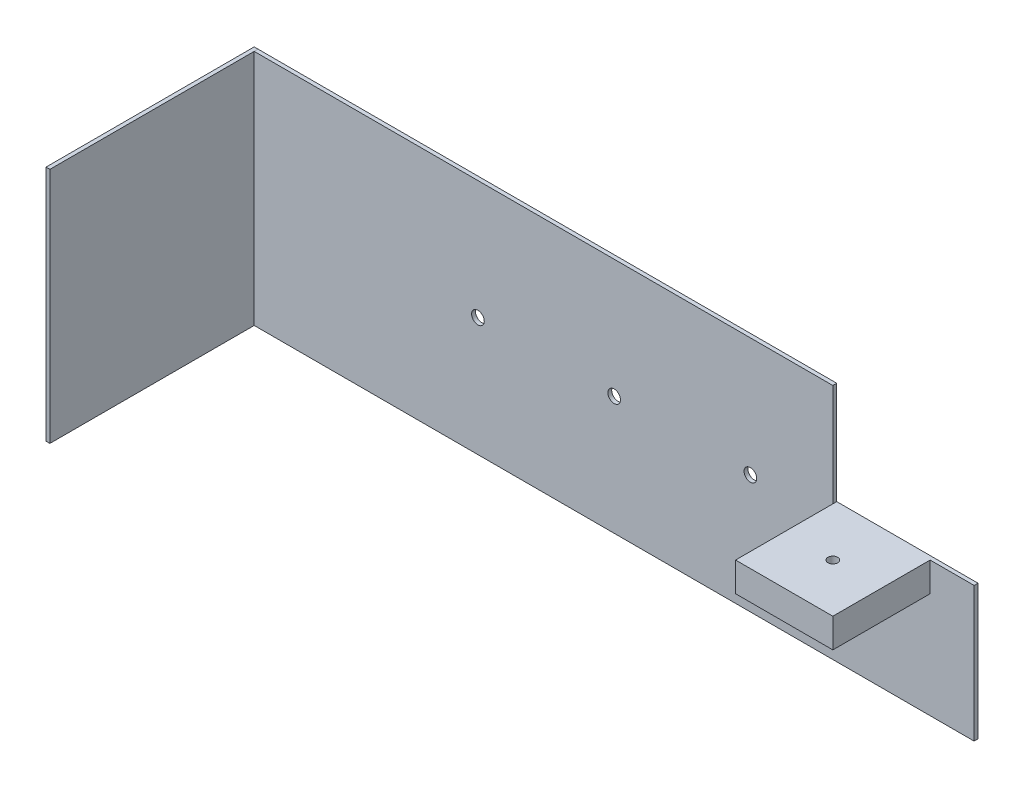
ISO-10303-21;
HEADER;
FILE_DESCRIPTION(('STEP AP214'),'2;1');
FILE_NAME('part.step','',(''),(''),'','','');
FILE_SCHEMA(('AUTOMOTIVE_DESIGN { 1 0 10303 214 1 1 1 1 }'));
ENDSEC;
DATA;
#1=APPLICATION_CONTEXT('core data for automotive mechanical design processes');
#2=APPLICATION_PROTOCOL_DEFINITION('international standard','automotive_design',2000,#1);
#3=PRODUCT_CONTEXT('',#1,'mechanical');
#4=PRODUCT('Part','Part','',(#3));
#5=PRODUCT_RELATED_PRODUCT_CATEGORY('part','',(#4));
#6=PRODUCT_DEFINITION_FORMATION('','',#4);
#7=PRODUCT_DEFINITION_CONTEXT('part definition',#1,'design');
#8=PRODUCT_DEFINITION('design','',#6,#7);
#9=PRODUCT_DEFINITION_SHAPE('','',#8);
#10=(LENGTH_UNIT() NAMED_UNIT(*) SI_UNIT(.MILLI.,.METRE.));
#11=(NAMED_UNIT(*) PLANE_ANGLE_UNIT() SI_UNIT($,.RADIAN.));
#12=(NAMED_UNIT(*) SI_UNIT($,.STERADIAN.) SOLID_ANGLE_UNIT());
#13=UNCERTAINTY_MEASURE_WITH_UNIT(LENGTH_MEASURE(1.E-05),#10,'distance_accuracy_value','');
#14=(GEOMETRIC_REPRESENTATION_CONTEXT(3) GLOBAL_UNCERTAINTY_ASSIGNED_CONTEXT((#13)) GLOBAL_UNIT_ASSIGNED_CONTEXT((#10,
#11,#12)) REPRESENTATION_CONTEXT('',''));
#15=CARTESIAN_POINT('',(0.,0.,0.));
#16=DIRECTION('',(0.,0.,1.));
#17=DIRECTION('',(1.,0.,0.));
#18=AXIS2_PLACEMENT_3D('',#15,#16,#17);
#19=CARTESIAN_POINT('',(-185.,61.,0.));
#20=DIRECTION('',(1.,0.,0.));
#21=DIRECTION('',(0.,1.,0.));
#22=AXIS2_PLACEMENT_3D('',#19,#20,#21);
#23=PLANE('',#22);
#24=DIRECTION('',(0.,0.,1.));
#25=VECTOR('',#24,1.);
#26=CARTESIAN_POINT('',(-185.,61.,0.));
#27=LINE('',#26,#25);
#28=CARTESIAN_POINT('',(-185.,61.,0.));
#29=VERTEX_POINT('',#28);
#30=CARTESIAN_POINT('',(-185.,61.,107.));
#31=VERTEX_POINT('',#30);
#32=EDGE_CURVE('E49',#29,#31,#27,.T.);
#33=ORIENTED_EDGE('',*,*,#32,.T.);
#34=DIRECTION('',(0.,1.,0.));
#35=VECTOR('',#34,1.);
#36=CARTESIAN_POINT('',(-185.,61.,107.));
#37=LINE('',#36,#35);
#38=CARTESIAN_POINT('',(-185.,-61.,107.));
#39=VERTEX_POINT('',#38);
#40=EDGE_CURVE('E86',#39,#31,#37,.T.);
#41=ORIENTED_EDGE('',*,*,#40,.F.);
#42=DIRECTION('',(0.,0.,1.));
#43=VECTOR('',#42,1.);
#44=CARTESIAN_POINT('',(-185.,-61.,0.));
#45=LINE('',#44,#43);
#46=CARTESIAN_POINT('',(-185.,-61.,0.));
#47=VERTEX_POINT('',#46);
#48=EDGE_CURVE('E12',#47,#39,#45,.T.);
#49=ORIENTED_EDGE('',*,*,#48,.F.);
#50=DIRECTION('',(0.,1.,0.));
#51=VECTOR('',#50,1.);
#52=CARTESIAN_POINT('',(-185.,61.,0.));
#53=LINE('',#52,#51);
#54=EDGE_CURVE('E87',#47,#29,#53,.T.);
#55=ORIENTED_EDGE('',*,*,#54,.T.);
#56=EDGE_LOOP('',(#33,#41,#49,#55));
#57=FACE_BOUND('',#56,.T.);
#58=ADVANCED_FACE('F46',(#57),#23,.T.);
#59=CARTESIAN_POINT('',(-185.,-61.,0.));
#60=DIRECTION('',(0.,-1.,0.));
#61=DIRECTION('',(0.,0.,-1.));
#62=AXIS2_PLACEMENT_3D('',#59,#60,#61);
#63=PLANE('',#62);
#64=ORIENTED_EDGE('',*,*,#48,.T.);
#65=DIRECTION('',(1.,0.,0.));
#66=VECTOR('',#65,1.);
#67=CARTESIAN_POINT('',(-185.,-61.,107.));
#68=LINE('',#67,#66);
#69=CARTESIAN_POINT('',(-187.,-61.,107.));
#70=VERTEX_POINT('',#69);
#71=EDGE_CURVE('E103',#70,#39,#68,.T.);
#72=ORIENTED_EDGE('',*,*,#71,.F.);
#73=DIRECTION('',(0.,0.,1.));
#74=VECTOR('',#73,1.);
#75=CARTESIAN_POINT('',(-187.,-61.,0.));
#76=LINE('',#75,#74);
#77=CARTESIAN_POINT('',(-187.,-61.,0.));
#78=VERTEX_POINT('',#77);
#79=EDGE_CURVE('E54',#78,#70,#76,.T.);
#80=ORIENTED_EDGE('',*,*,#79,.F.);
#81=DIRECTION('',(1.,0.,0.));
#82=VECTOR('',#81,1.);
#83=CARTESIAN_POINT('',(-185.,-61.,0.));
#84=LINE('',#83,#82);
#85=EDGE_CURVE('E92',#78,#47,#84,.T.);
#86=ORIENTED_EDGE('',*,*,#85,.T.);
#87=EDGE_LOOP('',(#64,#72,#80,#86));
#88=FACE_BOUND('',#87,.T.);
#89=ADVANCED_FACE('F118',(#88),#63,.T.);
#90=CARTESIAN_POINT('',(-187.,61.,0.));
#91=DIRECTION('',(-1.,0.,0.));
#92=DIRECTION('',(0.,-1.,0.));
#93=AXIS2_PLACEMENT_3D('',#90,#91,#92);
#94=PLANE('',#93);
#95=ORIENTED_EDGE('',*,*,#79,.T.);
#96=DIRECTION('',(0.,-1.,0.));
#97=VECTOR('',#96,1.);
#98=CARTESIAN_POINT('',(-187.,61.,107.));
#99=LINE('',#98,#97);
#100=CARTESIAN_POINT('',(-187.,61.,107.));
#101=VERTEX_POINT('',#100);
#102=EDGE_CURVE('E99',#101,#70,#99,.T.);
#103=ORIENTED_EDGE('',*,*,#102,.F.);
#104=DIRECTION('',(0.,0.,1.));
#105=VECTOR('',#104,1.);
#106=CARTESIAN_POINT('',(-187.,61.,0.));
#107=LINE('',#106,#105);
#108=CARTESIAN_POINT('',(-187.,61.,0.));
#109=VERTEX_POINT('',#108);
#110=EDGE_CURVE('E91',#109,#101,#107,.T.);
#111=ORIENTED_EDGE('',*,*,#110,.F.);
#112=DIRECTION('',(0.,-1.,0.));
#113=VECTOR('',#112,1.);
#114=CARTESIAN_POINT('',(-187.,61.,0.));
#115=LINE('',#114,#113);
#116=EDGE_CURVE('E111',#109,#78,#115,.T.);
#117=ORIENTED_EDGE('',*,*,#116,.T.);
#118=EDGE_LOOP('',(#95,#103,#111,#117));
#119=FACE_BOUND('',#118,.T.);
#120=ADVANCED_FACE('F115',(#119),#94,.T.);
#121=CARTESIAN_POINT('',(-185.,61.,0.));
#122=DIRECTION('',(0.,1.,0.));
#123=DIRECTION('',(0.,0.,1.));
#124=AXIS2_PLACEMENT_3D('',#121,#122,#123);
#125=PLANE('',#124);
#126=ORIENTED_EDGE('',*,*,#110,.T.);
#127=DIRECTION('',(-1.,0.,0.));
#128=VECTOR('',#127,1.);
#129=CARTESIAN_POINT('',(-185.,61.,107.));
#130=LINE('',#129,#128);
#131=EDGE_CURVE('E94',#31,#101,#130,.T.);
#132=ORIENTED_EDGE('',*,*,#131,.F.);
#133=ORIENTED_EDGE('',*,*,#32,.F.);
#134=DIRECTION('',(-1.,0.,0.));
#135=VECTOR('',#134,1.);
#136=CARTESIAN_POINT('',(-185.,61.,0.));
#137=LINE('',#136,#135);
#138=EDGE_CURVE('E109',#29,#109,#137,.T.);
#139=ORIENTED_EDGE('',*,*,#138,.T.);
#140=EDGE_LOOP('',(#126,#132,#133,#139));
#141=FACE_BOUND('',#140,.T.);
#142=ADVANCED_FACE('F95',(#141),#125,.T.);
#143=CARTESIAN_POINT('',(0.,0.,0.));
#144=DIRECTION('',(0.,0.,-1.));
#145=DIRECTION('',(-1.,0.,0.));
#146=AXIS2_PLACEMENT_3D('',#143,#144,#145);
#147=PLANE('',#146);
#148=ORIENTED_EDGE('',*,*,#54,.F.);
#149=ORIENTED_EDGE('',*,*,#85,.F.);
#150=ORIENTED_EDGE('',*,*,#116,.F.);
#151=ORIENTED_EDGE('',*,*,#138,.F.);
#152=EDGE_LOOP('',(#148,#149,#150,#151));
#153=FACE_BOUND('',#152,.T.);
#154=ADVANCED_FACE('F120',(#153),#147,.T.);
#155=CARTESIAN_POINT('',(0.,0.,107.));
#156=DIRECTION('',(0.,0.,-1.));
#157=DIRECTION('',(-1.,0.,0.));
#158=AXIS2_PLACEMENT_3D('',#155,#156,#157);
#159=PLANE('',#158);
#160=ORIENTED_EDGE('',*,*,#40,.T.);
#161=ORIENTED_EDGE('',*,*,#131,.T.);
#162=ORIENTED_EDGE('',*,*,#102,.T.);
#163=ORIENTED_EDGE('',*,*,#71,.T.);
#164=EDGE_LOOP('',(#160,#161,#162,#163));
#165=FACE_BOUND('',#164,.T.);
#166=ADVANCED_FACE('F102',(#165),#159,.F.);
#167=CLOSED_SHELL('',(#58,#89,#120,#142,#154,#166));
#168=MANIFOLD_SOLID_BREP('B2',#167);
#169=CARTESIAN_POINT('',(0.,0.,2.));
#170=DIRECTION('',(0.,0.,1.));
#171=DIRECTION('',(1.,0.,0.));
#172=AXIS2_PLACEMENT_3D('',#169,#170,#171);
#173=PLANE('',#172);
#174=CARTESIAN_POINT('',(0.,0.,2.));
#175=DIRECTION('',(0.,0.,1.));
#176=DIRECTION('',(1.,0.,0.));
#177=AXIS2_PLACEMENT_3D('',#174,#175,#176);
#178=CIRCLE('',#177,3.25);
#179=CARTESIAN_POINT('',(3.25,0.,2.));
#180=VERTEX_POINT('',#179);
#181=EDGE_CURVE('E431',#180,#180,#178,.T.);
#182=ORIENTED_EDGE('',*,*,#181,.F.);
#183=EDGE_LOOP('',(#182));
#184=FACE_BOUND('',#183,.T.);
#185=CARTESIAN_POINT('',(70.,0.,2.));
#186=DIRECTION('',(0.,0.,1.));
#187=DIRECTION('',(1.,0.,0.));
#188=AXIS2_PLACEMENT_3D('',#185,#186,#187);
#189=CIRCLE('',#188,3.25000000000001);
#190=CARTESIAN_POINT('',(73.25,0.,2.));
#191=VERTEX_POINT('',#190);
#192=EDGE_CURVE('E349',#191,#191,#189,.T.);
#193=ORIENTED_EDGE('',*,*,#192,.F.);
#194=EDGE_LOOP('',(#193));
#195=FACE_BOUND('',#194,.T.);
#196=CARTESIAN_POINT('',(-70.,0.,2.));
#197=DIRECTION('',(0.,0.,1.));
#198=DIRECTION('',(1.,0.,0.));
#199=AXIS2_PLACEMENT_3D('',#196,#197,#198);
#200=CIRCLE('',#199,3.25000000000001);
#201=CARTESIAN_POINT('',(-66.75,0.,2.));
#202=VERTEX_POINT('',#201);
#203=EDGE_CURVE('E343',#202,#202,#200,.T.);
#204=ORIENTED_EDGE('',*,*,#203,.F.);
#205=EDGE_LOOP('',(#204));
#206=FACE_BOUND('',#205,.T.);
#207=DIRECTION('',(1.,0.,0.));
#208=VECTOR('',#207,1.);
#209=CARTESIAN_POINT('',(185.,8.3,2.));
#210=LINE('',#209,#208);
#211=CARTESIAN_POINT('',(162.4,8.3,2.));
#212=VERTEX_POINT('',#211);
#213=CARTESIAN_POINT('',(185.,8.3,2.));
#214=VERTEX_POINT('',#213);
#215=EDGE_CURVE('E265',#212,#214,#210,.T.);
#216=ORIENTED_EDGE('',*,*,#215,.F.);
#217=DIRECTION('',(0.,1.,0.));
#218=VECTOR('',#217,1.);
#219=CARTESIAN_POINT('',(162.4,8.3,2.));
#220=LINE('',#219,#218);
#221=CARTESIAN_POINT('',(162.4,-6.7,2.));
#222=VERTEX_POINT('',#221);
#223=EDGE_CURVE('E362',#222,#212,#220,.T.);
#224=ORIENTED_EDGE('',*,*,#223,.F.);
#225=DIRECTION('',(1.,0.,0.));
#226=VECTOR('',#225,1.);
#227=CARTESIAN_POINT('',(112.4,-6.7,2.));
#228=LINE('',#227,#226);
#229=CARTESIAN_POINT('',(112.4,-6.7,2.));
#230=VERTEX_POINT('',#229);
#231=EDGE_CURVE('E367',#230,#222,#228,.T.);
#232=ORIENTED_EDGE('',*,*,#231,.F.);
#233=DIRECTION('',(0.,-1.,0.));
#234=VECTOR('',#233,1.);
#235=CARTESIAN_POINT('',(112.4,8.3,2.));
#236=LINE('',#235,#234);
#237=CARTESIAN_POINT('',(112.4,8.3,2.));
#238=VERTEX_POINT('',#237);
#239=EDGE_CURVE('E376',#238,#230,#236,.T.);
#240=ORIENTED_EDGE('',*,*,#239,.F.);
#241=DIRECTION('',(0.,-1.,0.));
#242=VECTOR('',#241,1.);
#243=CARTESIAN_POINT('',(112.4,61.,2.));
#244=LINE('',#243,#242);
#245=CARTESIAN_POINT('',(112.4,61.,2.));
#246=VERTEX_POINT('',#245);
#247=EDGE_CURVE('E342',#246,#238,#244,.T.);
#248=ORIENTED_EDGE('',*,*,#247,.F.);
#249=DIRECTION('',(-1.,0.,0.));
#250=VECTOR('',#249,1.);
#251=CARTESIAN_POINT('',(-185.,61.,2.));
#252=LINE('',#251,#250);
#253=CARTESIAN_POINT('',(-185.,61.,2.));
#254=VERTEX_POINT('',#253);
#255=EDGE_CURVE('E216',#246,#254,#252,.T.);
#256=ORIENTED_EDGE('',*,*,#255,.T.);
#257=DIRECTION('',(0.,-1.,0.));
#258=VECTOR('',#257,1.);
#259=CARTESIAN_POINT('',(-185.,61.,2.));
#260=LINE('',#259,#258);
#261=CARTESIAN_POINT('',(-185.,-61.,2.));
#262=VERTEX_POINT('',#261);
#263=EDGE_CURVE('E295',#254,#262,#260,.T.);
#264=ORIENTED_EDGE('',*,*,#263,.T.);
#265=DIRECTION('',(1.,0.,0.));
#266=VECTOR('',#265,1.);
#267=CARTESIAN_POINT('',(-185.,-61.,2.));
#268=LINE('',#267,#266);
#269=CARTESIAN_POINT('',(185.,-61.,2.));
#270=VERTEX_POINT('',#269);
#271=EDGE_CURVE('E194',#262,#270,#268,.T.);
#272=ORIENTED_EDGE('',*,*,#271,.T.);
#273=DIRECTION('',(0.,1.,0.));
#274=VECTOR('',#273,1.);
#275=CARTESIAN_POINT('',(185.,61.,2.));
#276=LINE('',#275,#274);
#277=EDGE_CURVE('E283',#270,#214,#276,.T.);
#278=ORIENTED_EDGE('',*,*,#277,.T.);
#279=EDGE_LOOP('',(#216,#224,#232,#240,#248,#256,#264,#272,#278));
#280=FACE_BOUND('',#279,.T.);
#281=ADVANCED_FACE('F170',(#184,#195,#206,#280),#173,.T.);
#282=CARTESIAN_POINT('',(185.,61.,2.));
#283=DIRECTION('',(-1.,0.,0.));
#284=DIRECTION('',(0.,-1.,0.));
#285=AXIS2_PLACEMENT_3D('',#282,#283,#284);
#286=PLANE('',#285);
#287=DIRECTION('',(0.,1.,0.));
#288=VECTOR('',#287,1.);
#289=CARTESIAN_POINT('',(185.,61.,0.));
#290=LINE('',#289,#288);
#291=CARTESIAN_POINT('',(185.,-61.,0.));
#292=VERTEX_POINT('',#291);
#293=CARTESIAN_POINT('',(185.,8.3,0.));
#294=VERTEX_POINT('',#293);
#295=EDGE_CURVE('E274',#292,#294,#290,.T.);
#296=ORIENTED_EDGE('',*,*,#295,.T.);
#297=DIRECTION('',(0.,0.,1.));
#298=VECTOR('',#297,1.);
#299=CARTESIAN_POINT('',(185.,8.3,0.));
#300=LINE('',#299,#298);
#301=EDGE_CURVE('E293',#294,#214,#300,.T.);
#302=ORIENTED_EDGE('',*,*,#301,.T.);
#303=ORIENTED_EDGE('',*,*,#277,.F.);
#304=DIRECTION('',(0.,0.,-1.));
#305=VECTOR('',#304,1.);
#306=CARTESIAN_POINT('',(185.,-61.,2.));
#307=LINE('',#306,#305);
#308=EDGE_CURVE('E284',#270,#292,#307,.T.);
#309=ORIENTED_EDGE('',*,*,#308,.T.);
#310=EDGE_LOOP('',(#296,#302,#303,#309));
#311=FACE_BOUND('',#310,.T.);
#312=ADVANCED_FACE('F172',(#311),#286,.F.);
#313=CARTESIAN_POINT('',(-185.,61.,2.));
#314=DIRECTION('',(0.,-1.,0.));
#315=DIRECTION('',(0.,0.,-1.));
#316=AXIS2_PLACEMENT_3D('',#313,#314,#315);
#317=PLANE('',#316);
#318=ORIENTED_EDGE('',*,*,#255,.F.);
#319=DIRECTION('',(0.,0.,1.));
#320=VECTOR('',#319,1.);
#321=CARTESIAN_POINT('',(112.4,61.,0.));
#322=LINE('',#321,#320);
#323=CARTESIAN_POINT('',(112.4,61.,0.));
#324=VERTEX_POINT('',#323);
#325=EDGE_CURVE('E257',#324,#246,#322,.T.);
#326=ORIENTED_EDGE('',*,*,#325,.F.);
#327=DIRECTION('',(-1.,0.,0.));
#328=VECTOR('',#327,1.);
#329=CARTESIAN_POINT('',(-185.,61.,0.));
#330=LINE('',#329,#328);
#331=CARTESIAN_POINT('',(-185.,61.,0.));
#332=VERTEX_POINT('',#331);
#333=EDGE_CURVE('E269',#324,#332,#330,.T.);
#334=ORIENTED_EDGE('',*,*,#333,.T.);
#335=DIRECTION('',(0.,0.,-1.));
#336=VECTOR('',#335,1.);
#337=CARTESIAN_POINT('',(-185.,61.,2.));
#338=LINE('',#337,#336);
#339=EDGE_CURVE('E44',#254,#332,#338,.T.);
#340=ORIENTED_EDGE('',*,*,#339,.F.);
#341=EDGE_LOOP('',(#318,#326,#334,#340));
#342=FACE_BOUND('',#341,.T.);
#343=ADVANCED_FACE('F268',(#342),#317,.F.);
#344=CARTESIAN_POINT('',(-185.,61.,2.));
#345=DIRECTION('',(1.,0.,0.));
#346=DIRECTION('',(0.,0.,-1.));
#347=AXIS2_PLACEMENT_3D('',#344,#345,#346);
#348=PLANE('',#347);
#349=DIRECTION('',(0.,-1.,0.));
#350=VECTOR('',#349,1.);
#351=CARTESIAN_POINT('',(-185.,61.,0.));
#352=LINE('',#351,#350);
#353=CARTESIAN_POINT('',(-185.,-61.,0.));
#354=VERTEX_POINT('',#353);
#355=EDGE_CURVE('E273',#332,#354,#352,.T.);
#356=ORIENTED_EDGE('',*,*,#355,.T.);
#357=DIRECTION('',(0.,0.,-1.));
#358=VECTOR('',#357,1.);
#359=CARTESIAN_POINT('',(-185.,-61.,2.));
#360=LINE('',#359,#358);
#361=EDGE_CURVE('E178',#262,#354,#360,.T.);
#362=ORIENTED_EDGE('',*,*,#361,.F.);
#363=ORIENTED_EDGE('',*,*,#263,.F.);
#364=ORIENTED_EDGE('',*,*,#339,.T.);
#365=EDGE_LOOP('',(#356,#362,#363,#364));
#366=FACE_BOUND('',#365,.T.);
#367=ADVANCED_FACE('F300',(#366),#348,.F.);
#368=CARTESIAN_POINT('',(-185.,-61.,2.));
#369=DIRECTION('',(0.,1.,0.));
#370=DIRECTION('',(0.,0.,1.));
#371=AXIS2_PLACEMENT_3D('',#368,#369,#370);
#372=PLANE('',#371);
#373=DIRECTION('',(1.,0.,0.));
#374=VECTOR('',#373,1.);
#375=CARTESIAN_POINT('',(-185.,-61.,0.));
#376=LINE('',#375,#374);
#377=EDGE_CURVE('E211',#354,#292,#376,.T.);
#378=ORIENTED_EDGE('',*,*,#377,.T.);
#379=ORIENTED_EDGE('',*,*,#308,.F.);
#380=ORIENTED_EDGE('',*,*,#271,.F.);
#381=ORIENTED_EDGE('',*,*,#361,.T.);
#382=EDGE_LOOP('',(#378,#379,#380,#381));
#383=FACE_BOUND('',#382,.T.);
#384=ADVANCED_FACE('F286',(#383),#372,.F.);
#385=CARTESIAN_POINT('',(0.,0.,0.));
#386=DIRECTION('',(0.,0.,1.));
#387=DIRECTION('',(1.,0.,0.));
#388=AXIS2_PLACEMENT_3D('',#385,#386,#387);
#389=PLANE('',#388);
#390=CARTESIAN_POINT('',(0.,0.,0.));
#391=DIRECTION('',(0.,0.,1.));
#392=DIRECTION('',(1.,0.,0.));
#393=AXIS2_PLACEMENT_3D('',#390,#391,#392);
#394=CIRCLE('',#393,3.25);
#395=CARTESIAN_POINT('',(3.25,0.,0.));
#396=VERTEX_POINT('',#395);
#397=EDGE_CURVE('E333',#396,#396,#394,.T.);
#398=ORIENTED_EDGE('',*,*,#397,.T.);
#399=EDGE_LOOP('',(#398));
#400=FACE_BOUND('',#399,.T.);
#401=CARTESIAN_POINT('',(70.,0.,0.));
#402=DIRECTION('',(0.,0.,1.));
#403=DIRECTION('',(1.,0.,0.));
#404=AXIS2_PLACEMENT_3D('',#401,#402,#403);
#405=CIRCLE('',#404,3.25000000000001);
#406=CARTESIAN_POINT('',(73.25,0.,0.));
#407=VERTEX_POINT('',#406);
#408=EDGE_CURVE('E337',#407,#407,#405,.T.);
#409=ORIENTED_EDGE('',*,*,#408,.T.);
#410=EDGE_LOOP('',(#409));
#411=FACE_BOUND('',#410,.T.);
#412=CARTESIAN_POINT('',(-70.,0.,0.));
#413=DIRECTION('',(0.,0.,1.));
#414=DIRECTION('',(1.,0.,0.));
#415=AXIS2_PLACEMENT_3D('',#412,#413,#414);
#416=CIRCLE('',#415,3.25000000000001);
#417=CARTESIAN_POINT('',(-66.75,0.,0.));
#418=VERTEX_POINT('',#417);
#419=EDGE_CURVE('E340',#418,#418,#416,.T.);
#420=ORIENTED_EDGE('',*,*,#419,.T.);
#421=EDGE_LOOP('',(#420));
#422=FACE_BOUND('',#421,.T.);
#423=DIRECTION('',(0.,-1.,0.));
#424=VECTOR('',#423,1.);
#425=CARTESIAN_POINT('',(112.4,61.,0.));
#426=LINE('',#425,#424);
#427=CARTESIAN_POINT('',(112.4,8.3,0.));
#428=VERTEX_POINT('',#427);
#429=EDGE_CURVE('E254',#324,#428,#426,.T.);
#430=ORIENTED_EDGE('',*,*,#429,.T.);
#431=DIRECTION('',(1.,0.,0.));
#432=VECTOR('',#431,1.);
#433=CARTESIAN_POINT('',(185.,8.3,0.));
#434=LINE('',#433,#432);
#435=EDGE_CURVE('E264',#428,#294,#434,.T.);
#436=ORIENTED_EDGE('',*,*,#435,.T.);
#437=ORIENTED_EDGE('',*,*,#295,.F.);
#438=ORIENTED_EDGE('',*,*,#377,.F.);
#439=ORIENTED_EDGE('',*,*,#355,.F.);
#440=ORIENTED_EDGE('',*,*,#333,.F.);
#441=EDGE_LOOP('',(#430,#436,#437,#438,#439,#440));
#442=FACE_BOUND('',#441,.T.);
#443=ADVANCED_FACE('F272',(#400,#411,#422,#442),#389,.F.);
#444=CARTESIAN_POINT('',(162.4,8.3,52.));
#445=DIRECTION('',(-1.,0.,0.));
#446=DIRECTION('',(0.,0.,1.));
#447=AXIS2_PLACEMENT_3D('',#444,#445,#446);
#448=PLANE('',#447);
#449=ORIENTED_EDGE('',*,*,#223,.T.);
#450=DIRECTION('',(0.,0.,-1.));
#451=VECTOR('',#450,1.);
#452=CARTESIAN_POINT('',(162.4,8.3,52.));
#453=LINE('',#452,#451);
#454=CARTESIAN_POINT('',(162.4,8.3,52.));
#455=VERTEX_POINT('',#454);
#456=EDGE_CURVE('E278',#455,#212,#453,.T.);
#457=ORIENTED_EDGE('',*,*,#456,.F.);
#458=DIRECTION('',(0.,1.,0.));
#459=VECTOR('',#458,1.);
#460=CARTESIAN_POINT('',(162.4,8.3,52.));
#461=LINE('',#460,#459);
#462=CARTESIAN_POINT('',(162.4,-6.7,52.));
#463=VERTEX_POINT('',#462);
#464=EDGE_CURVE('E363',#463,#455,#461,.T.);
#465=ORIENTED_EDGE('',*,*,#464,.F.);
#466=DIRECTION('',(0.,0.,-1.));
#467=VECTOR('',#466,1.);
#468=CARTESIAN_POINT('',(162.4,-6.7,52.));
#469=LINE('',#468,#467);
#470=EDGE_CURVE('E373',#463,#222,#469,.T.);
#471=ORIENTED_EDGE('',*,*,#470,.T.);
#472=EDGE_LOOP('',(#449,#457,#465,#471));
#473=FACE_BOUND('',#472,.T.);
#474=ADVANCED_FACE('F321',(#473),#448,.F.);
#475=CARTESIAN_POINT('',(112.4,8.3,52.));
#476=DIRECTION('',(0.,-1.,0.));
#477=DIRECTION('',(0.,0.,-1.));
#478=AXIS2_PLACEMENT_3D('',#475,#476,#477);
#479=PLANE('',#478);
#480=CARTESIAN_POINT('',(137.4,8.3,27.));
#481=DIRECTION('',(0.,1.,0.));
#482=DIRECTION('',(0.,0.,1.));
#483=AXIS2_PLACEMENT_3D('',#480,#481,#482);
#484=CIRCLE('',#483,2.5);
#485=CARTESIAN_POINT('',(137.4,8.3,29.5));
#486=VERTEX_POINT('',#485);
#487=EDGE_CURVE('E355',#486,#486,#484,.T.);
#488=ORIENTED_EDGE('',*,*,#487,.F.);
#489=EDGE_LOOP('',(#488));
#490=FACE_BOUND('',#489,.T.);
#491=ORIENTED_EDGE('',*,*,#456,.T.);
#492=ORIENTED_EDGE('',*,*,#215,.T.);
#493=ORIENTED_EDGE('',*,*,#301,.F.);
#494=ORIENTED_EDGE('',*,*,#435,.F.);
#495=DIRECTION('',(0.,0.,1.));
#496=VECTOR('',#495,1.);
#497=CARTESIAN_POINT('',(112.4,8.3,0.));
#498=LINE('',#497,#496);
#499=EDGE_CURVE('E259',#428,#238,#498,.T.);
#500=ORIENTED_EDGE('',*,*,#499,.T.);
#501=DIRECTION('',(0.,0.,-1.));
#502=VECTOR('',#501,1.);
#503=CARTESIAN_POINT('',(112.4,8.3,52.));
#504=LINE('',#503,#502);
#505=CARTESIAN_POINT('',(112.4,8.3,52.));
#506=VERTEX_POINT('',#505);
#507=EDGE_CURVE('E381',#506,#238,#504,.T.);
#508=ORIENTED_EDGE('',*,*,#507,.F.);
#509=DIRECTION('',(-1.,0.,0.));
#510=VECTOR('',#509,1.);
#511=CARTESIAN_POINT('',(112.4,8.3,52.));
#512=LINE('',#511,#510);
#513=EDGE_CURVE('E366',#455,#506,#512,.T.);
#514=ORIENTED_EDGE('',*,*,#513,.F.);
#515=EDGE_LOOP('',(#491,#492,#493,#494,#500,#508,#514));
#516=FACE_BOUND('',#515,.T.);
#517=ADVANCED_FACE('F328',(#490,#516),#479,.F.);
#518=CARTESIAN_POINT('',(112.4,8.3,52.));
#519=DIRECTION('',(1.,0.,0.));
#520=DIRECTION('',(0.,0.,-1.));
#521=AXIS2_PLACEMENT_3D('',#518,#519,#520);
#522=PLANE('',#521);
#523=ORIENTED_EDGE('',*,*,#239,.T.);
#524=DIRECTION('',(0.,0.,-1.));
#525=VECTOR('',#524,1.);
#526=CARTESIAN_POINT('',(112.4,-6.7,52.));
#527=LINE('',#526,#525);
#528=CARTESIAN_POINT('',(112.4,-6.7,52.));
#529=VERTEX_POINT('',#528);
#530=EDGE_CURVE('E185',#529,#230,#527,.T.);
#531=ORIENTED_EDGE('',*,*,#530,.F.);
#532=DIRECTION('',(0.,-1.,0.));
#533=VECTOR('',#532,1.);
#534=CARTESIAN_POINT('',(112.4,8.3,52.));
#535=LINE('',#534,#533);
#536=EDGE_CURVE('E369',#506,#529,#535,.T.);
#537=ORIENTED_EDGE('',*,*,#536,.F.);
#538=ORIENTED_EDGE('',*,*,#507,.T.);
#539=EDGE_LOOP('',(#523,#531,#537,#538));
#540=FACE_BOUND('',#539,.T.);
#541=ADVANCED_FACE('F397',(#540),#522,.F.);
#542=CARTESIAN_POINT('',(112.4,-6.7,52.));
#543=DIRECTION('',(0.,1.,0.));
#544=DIRECTION('',(0.,0.,1.));
#545=AXIS2_PLACEMENT_3D('',#542,#543,#544);
#546=PLANE('',#545);
#547=CARTESIAN_POINT('',(137.4,-6.7,27.));
#548=DIRECTION('',(0.,1.,0.));
#549=DIRECTION('',(0.,0.,1.));
#550=AXIS2_PLACEMENT_3D('',#547,#548,#549);
#551=CIRCLE('',#550,2.5);
#552=CARTESIAN_POINT('',(137.4,-6.7,29.5));
#553=VERTEX_POINT('',#552);
#554=EDGE_CURVE('E359',#553,#553,#551,.T.);
#555=ORIENTED_EDGE('',*,*,#554,.T.);
#556=EDGE_LOOP('',(#555));
#557=FACE_BOUND('',#556,.T.);
#558=ORIENTED_EDGE('',*,*,#231,.T.);
#559=ORIENTED_EDGE('',*,*,#470,.F.);
#560=DIRECTION('',(1.,0.,0.));
#561=VECTOR('',#560,1.);
#562=CARTESIAN_POINT('',(112.4,-6.7,52.));
#563=LINE('',#562,#561);
#564=EDGE_CURVE('E371',#529,#463,#563,.T.);
#565=ORIENTED_EDGE('',*,*,#564,.F.);
#566=ORIENTED_EDGE('',*,*,#530,.T.);
#567=EDGE_LOOP('',(#558,#559,#565,#566));
#568=FACE_BOUND('',#567,.T.);
#569=ADVANCED_FACE('F394',(#557,#568),#546,.F.);
#570=CARTESIAN_POINT('',(0.,0.,52.));
#571=DIRECTION('',(0.,0.,1.));
#572=DIRECTION('',(1.,0.,0.));
#573=AXIS2_PLACEMENT_3D('',#570,#571,#572);
#574=PLANE('',#573);
#575=ORIENTED_EDGE('',*,*,#464,.T.);
#576=ORIENTED_EDGE('',*,*,#513,.T.);
#577=ORIENTED_EDGE('',*,*,#536,.T.);
#578=ORIENTED_EDGE('',*,*,#564,.T.);
#579=EDGE_LOOP('',(#575,#576,#577,#578));
#580=FACE_BOUND('',#579,.T.);
#581=ADVANCED_FACE('F396',(#580),#574,.T.);
#582=CARTESIAN_POINT('',(137.4,8.3,27.));
#583=DIRECTION('',(0.,1.,0.));
#584=DIRECTION('',(0.,0.,1.));
#585=AXIS2_PLACEMENT_3D('',#582,#583,#584);
#586=CYLINDRICAL_SURFACE('',#585,2.5);
#587=ORIENTED_EDGE('',*,*,#554,.F.);
#588=EDGE_LOOP('',(#587));
#589=FACE_BOUND('',#588,.T.);
#590=ORIENTED_EDGE('',*,*,#487,.T.);
#591=EDGE_LOOP('',(#590));
#592=FACE_BOUND('',#591,.T.);
#593=ADVANCED_FACE('F411',(#589,#592),#586,.F.);
#594=CARTESIAN_POINT('',(112.4,61.,0.));
#595=DIRECTION('',(-1.,0.,0.));
#596=DIRECTION('',(0.,0.,1.));
#597=AXIS2_PLACEMENT_3D('',#594,#595,#596);
#598=PLANE('',#597);
#599=ORIENTED_EDGE('',*,*,#247,.T.);
#600=ORIENTED_EDGE('',*,*,#499,.F.);
#601=ORIENTED_EDGE('',*,*,#429,.F.);
#602=ORIENTED_EDGE('',*,*,#325,.T.);
#603=EDGE_LOOP('',(#599,#600,#601,#602));
#604=FACE_BOUND('',#603,.T.);
#605=ADVANCED_FACE('F256',(#604),#598,.F.);
#606=CARTESIAN_POINT('',(-70.,0.,0.));
#607=DIRECTION('',(0.,0.,1.));
#608=DIRECTION('',(1.,0.,0.));
#609=AXIS2_PLACEMENT_3D('',#606,#607,#608);
#610=CYLINDRICAL_SURFACE('',#609,3.25000000000001);
#611=ORIENTED_EDGE('',*,*,#419,.F.);
#612=EDGE_LOOP('',(#611));
#613=FACE_BOUND('',#612,.T.);
#614=ORIENTED_EDGE('',*,*,#203,.T.);
#615=EDGE_LOOP('',(#614));
#616=FACE_BOUND('',#615,.T.);
#617=ADVANCED_FACE('F417',(#613,#616),#610,.F.);
#618=CARTESIAN_POINT('',(70.,0.,0.));
#619=DIRECTION('',(0.,0.,1.));
#620=DIRECTION('',(1.,0.,0.));
#621=AXIS2_PLACEMENT_3D('',#618,#619,#620);
#622=CYLINDRICAL_SURFACE('',#621,3.25000000000001);
#623=ORIENTED_EDGE('',*,*,#408,.F.);
#624=EDGE_LOOP('',(#623));
#625=FACE_BOUND('',#624,.T.);
#626=ORIENTED_EDGE('',*,*,#192,.T.);
#627=EDGE_LOOP('',(#626));
#628=FACE_BOUND('',#627,.T.);
#629=ADVANCED_FACE('F420',(#625,#628),#622,.F.);
#630=CARTESIAN_POINT('',(0.,0.,0.));
#631=DIRECTION('',(0.,0.,1.));
#632=DIRECTION('',(1.,0.,0.));
#633=AXIS2_PLACEMENT_3D('',#630,#631,#632);
#634=CYLINDRICAL_SURFACE('',#633,3.25);
#635=ORIENTED_EDGE('',*,*,#397,.F.);
#636=EDGE_LOOP('',(#635));
#637=FACE_BOUND('',#636,.T.);
#638=ORIENTED_EDGE('',*,*,#181,.T.);
#639=EDGE_LOOP('',(#638));
#640=FACE_BOUND('',#639,.T.);
#641=ADVANCED_FACE('F423',(#637,#640),#634,.F.);
#642=CLOSED_SHELL('',(#281,#312,#343,#367,#384,#443,#474,#517,#541,#569,#581,#593,#605,#617,
#629,#641));
#643=MANIFOLD_SOLID_BREP('B6',#642);
#644=ADVANCED_BREP_SHAPE_REPRESENTATION('',(#18,#168,#643),#14);
#645=SHAPE_DEFINITION_REPRESENTATION(#9,#644);
ENDSEC;
END-ISO-10303-21;
